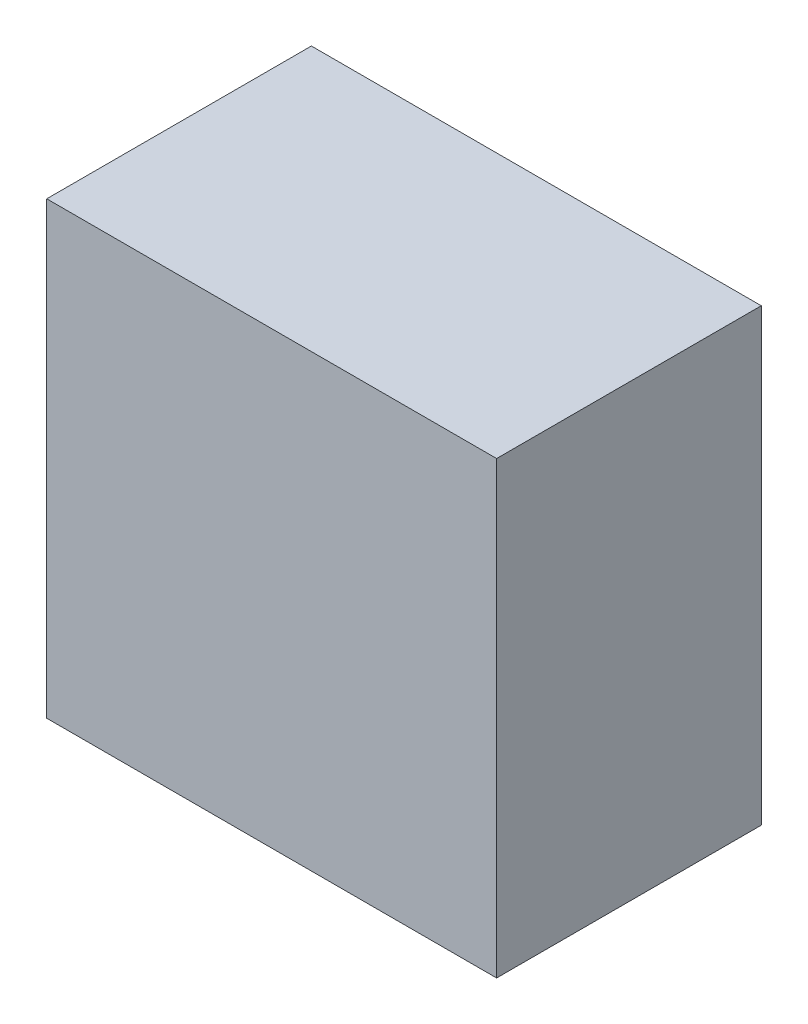
ISO-10303-21;
HEADER;
FILE_DESCRIPTION(('STEP AP214'),'2;1');
FILE_NAME('part.step','',(''),(''),'','','');
FILE_SCHEMA(('AUTOMOTIVE_DESIGN { 1 0 10303 214 1 1 1 1 }'));
ENDSEC;
DATA;
#1=APPLICATION_CONTEXT('core data for automotive mechanical design processes');
#2=APPLICATION_PROTOCOL_DEFINITION('international standard','automotive_design',2000,#1);
#3=PRODUCT_CONTEXT('',#1,'mechanical');
#4=PRODUCT('Part','Part','',(#3));
#5=PRODUCT_RELATED_PRODUCT_CATEGORY('part','',(#4));
#6=PRODUCT_DEFINITION_FORMATION('','',#4);
#7=PRODUCT_DEFINITION_CONTEXT('part definition',#1,'design');
#8=PRODUCT_DEFINITION('design','',#6,#7);
#9=PRODUCT_DEFINITION_SHAPE('','',#8);
#10=(LENGTH_UNIT() NAMED_UNIT(*) SI_UNIT(.MILLI.,.METRE.));
#11=(NAMED_UNIT(*) PLANE_ANGLE_UNIT() SI_UNIT($,.RADIAN.));
#12=(NAMED_UNIT(*) SI_UNIT($,.STERADIAN.) SOLID_ANGLE_UNIT());
#13=UNCERTAINTY_MEASURE_WITH_UNIT(LENGTH_MEASURE(1.E-05),#10,'distance_accuracy_value','');
#14=(GEOMETRIC_REPRESENTATION_CONTEXT(3) GLOBAL_UNCERTAINTY_ASSIGNED_CONTEXT((#13)) GLOBAL_UNIT_ASSIGNED_CONTEXT((#10,
#11,#12)) REPRESENTATION_CONTEXT('',''));
#15=CARTESIAN_POINT('',(0.,0.,0.));
#16=DIRECTION('',(0.,0.,1.));
#17=DIRECTION('',(1.,0.,0.));
#18=AXIS2_PLACEMENT_3D('',#15,#16,#17);
#19=CARTESIAN_POINT('',(-9.82758620689656,14.9310344827586,10.));
#20=DIRECTION('',(1.,0.,0.));
#21=DIRECTION('',(0.,1.,0.));
#22=AXIS2_PLACEMENT_3D('',#19,#20,#21);
#23=PLANE('',#22);
#24=DIRECTION('',(0.,-1.,0.));
#25=VECTOR('',#24,1.);
#26=CARTESIAN_POINT('',(-9.82758620689656,14.9310344827586,0.));
#27=LINE('',#26,#25);
#28=CARTESIAN_POINT('',(-9.82758620689656,14.9310344827586,0.));
#29=VERTEX_POINT('',#28);
#30=CARTESIAN_POINT('',(-9.82758620689656,-2.06896551724138,0.));
#31=VERTEX_POINT('',#30);
#32=EDGE_CURVE('E96',#29,#31,#27,.T.);
#33=ORIENTED_EDGE('',*,*,#32,.T.);
#34=DIRECTION('',(0.,0.,-1.));
#35=VECTOR('',#34,1.);
#36=CARTESIAN_POINT('',(-9.82758620689656,-2.06896551724138,10.));
#37=LINE('',#36,#35);
#38=CARTESIAN_POINT('',(-9.82758620689656,-2.06896551724138,10.));
#39=VERTEX_POINT('',#38);
#40=EDGE_CURVE('E11',#39,#31,#37,.T.);
#41=ORIENTED_EDGE('',*,*,#40,.F.);
#42=DIRECTION('',(0.,-1.,0.));
#43=VECTOR('',#42,1.);
#44=CARTESIAN_POINT('',(-9.82758620689656,14.9310344827586,10.));
#45=LINE('',#44,#43);
#46=CARTESIAN_POINT('',(-9.82758620689656,14.9310344827586,10.));
#47=VERTEX_POINT('',#46);
#48=EDGE_CURVE('E84',#47,#39,#45,.T.);
#49=ORIENTED_EDGE('',*,*,#48,.F.);
#50=DIRECTION('',(0.,0.,-1.));
#51=VECTOR('',#50,1.);
#52=CARTESIAN_POINT('',(-9.82758620689656,14.9310344827586,10.));
#53=LINE('',#52,#51);
#54=EDGE_CURVE('E92',#47,#29,#53,.T.);
#55=ORIENTED_EDGE('',*,*,#54,.T.);
#56=EDGE_LOOP('',(#33,#41,#49,#55));
#57=FACE_BOUND('',#56,.T.);
#58=ADVANCED_FACE('F33',(#57),#23,.F.);
#59=CARTESIAN_POINT('',(-9.82758620689656,-2.06896551724138,10.));
#60=DIRECTION('',(0.,1.,0.));
#61=DIRECTION('',(0.,0.,1.));
#62=AXIS2_PLACEMENT_3D('',#59,#60,#61);
#63=PLANE('',#62);
#64=DIRECTION('',(1.,0.,0.));
#65=VECTOR('',#64,1.);
#66=CARTESIAN_POINT('',(-9.82758620689656,-2.06896551724138,0.));
#67=LINE('',#66,#65);
#68=CARTESIAN_POINT('',(7.17241379310345,-2.06896551724138,0.));
#69=VERTEX_POINT('',#68);
#70=EDGE_CURVE('E88',#31,#69,#67,.T.);
#71=ORIENTED_EDGE('',*,*,#70,.T.);
#72=DIRECTION('',(0.,0.,-1.));
#73=VECTOR('',#72,1.);
#74=CARTESIAN_POINT('',(7.17241379310345,-2.06896551724138,10.));
#75=LINE('',#74,#73);
#76=CARTESIAN_POINT('',(7.17241379310345,-2.06896551724138,10.));
#77=VERTEX_POINT('',#76);
#78=EDGE_CURVE('E41',#77,#69,#75,.T.);
#79=ORIENTED_EDGE('',*,*,#78,.F.);
#80=DIRECTION('',(1.,0.,0.));
#81=VECTOR('',#80,1.);
#82=CARTESIAN_POINT('',(-9.82758620689656,-2.06896551724138,10.));
#83=LINE('',#82,#81);
#84=EDGE_CURVE('E79',#39,#77,#83,.T.);
#85=ORIENTED_EDGE('',*,*,#84,.F.);
#86=ORIENTED_EDGE('',*,*,#40,.T.);
#87=EDGE_LOOP('',(#71,#79,#85,#86));
#88=FACE_BOUND('',#87,.T.);
#89=ADVANCED_FACE('F87',(#88),#63,.F.);
#90=CARTESIAN_POINT('',(7.17241379310345,14.9310344827586,10.));
#91=DIRECTION('',(-1.,0.,0.));
#92=DIRECTION('',(0.,0.,1.));
#93=AXIS2_PLACEMENT_3D('',#90,#91,#92);
#94=PLANE('',#93);
#95=DIRECTION('',(0.,1.,0.));
#96=VECTOR('',#95,1.);
#97=CARTESIAN_POINT('',(7.17241379310345,14.9310344827586,0.));
#98=LINE('',#97,#96);
#99=CARTESIAN_POINT('',(7.17241379310345,14.9310344827586,0.));
#100=VERTEX_POINT('',#99);
#101=EDGE_CURVE('E66',#69,#100,#98,.T.);
#102=ORIENTED_EDGE('',*,*,#101,.T.);
#103=DIRECTION('',(0.,0.,-1.));
#104=VECTOR('',#103,1.);
#105=CARTESIAN_POINT('',(7.17241379310345,14.9310344827586,10.));
#106=LINE('',#105,#104);
#107=CARTESIAN_POINT('',(7.17241379310345,14.9310344827586,10.));
#108=VERTEX_POINT('',#107);
#109=EDGE_CURVE('E89',#108,#100,#106,.T.);
#110=ORIENTED_EDGE('',*,*,#109,.F.);
#111=DIRECTION('',(0.,1.,0.));
#112=VECTOR('',#111,1.);
#113=CARTESIAN_POINT('',(7.17241379310345,14.9310344827586,10.));
#114=LINE('',#113,#112);
#115=EDGE_CURVE('E82',#77,#108,#114,.T.);
#116=ORIENTED_EDGE('',*,*,#115,.F.);
#117=ORIENTED_EDGE('',*,*,#78,.T.);
#118=EDGE_LOOP('',(#102,#110,#116,#117));
#119=FACE_BOUND('',#118,.T.);
#120=ADVANCED_FACE('F90',(#119),#94,.F.);
#121=CARTESIAN_POINT('',(-9.82758620689656,14.9310344827586,10.));
#122=DIRECTION('',(0.,-1.,0.));
#123=DIRECTION('',(0.,0.,-1.));
#124=AXIS2_PLACEMENT_3D('',#121,#122,#123);
#125=PLANE('',#124);
#126=DIRECTION('',(-1.,0.,0.));
#127=VECTOR('',#126,1.);
#128=CARTESIAN_POINT('',(-9.82758620689656,14.9310344827586,0.));
#129=LINE('',#128,#127);
#130=EDGE_CURVE('E72',#100,#29,#129,.T.);
#131=ORIENTED_EDGE('',*,*,#130,.T.);
#132=ORIENTED_EDGE('',*,*,#54,.F.);
#133=DIRECTION('',(-1.,0.,0.));
#134=VECTOR('',#133,1.);
#135=CARTESIAN_POINT('',(-9.82758620689656,14.9310344827586,10.));
#136=LINE('',#135,#134);
#137=EDGE_CURVE('E49',#108,#47,#136,.T.);
#138=ORIENTED_EDGE('',*,*,#137,.F.);
#139=ORIENTED_EDGE('',*,*,#109,.T.);
#140=EDGE_LOOP('',(#131,#132,#138,#139));
#141=FACE_BOUND('',#140,.T.);
#142=ADVANCED_FACE('F103',(#141),#125,.F.);
#143=CARTESIAN_POINT('',(0.,0.,10.));
#144=DIRECTION('',(0.,0.,1.));
#145=DIRECTION('',(1.,0.,0.));
#146=AXIS2_PLACEMENT_3D('',#143,#144,#145);
#147=PLANE('',#146);
#148=ORIENTED_EDGE('',*,*,#48,.T.);
#149=ORIENTED_EDGE('',*,*,#84,.T.);
#150=ORIENTED_EDGE('',*,*,#115,.T.);
#151=ORIENTED_EDGE('',*,*,#137,.T.);
#152=EDGE_LOOP('',(#148,#149,#150,#151));
#153=FACE_BOUND('',#152,.T.);
#154=ADVANCED_FACE('F80',(#153),#147,.T.);
#155=CARTESIAN_POINT('',(0.,0.,0.));
#156=DIRECTION('',(0.,0.,1.));
#157=DIRECTION('',(1.,0.,0.));
#158=AXIS2_PLACEMENT_3D('',#155,#156,#157);
#159=PLANE('',#158);
#160=ORIENTED_EDGE('',*,*,#32,.F.);
#161=ORIENTED_EDGE('',*,*,#130,.F.);
#162=ORIENTED_EDGE('',*,*,#101,.F.);
#163=ORIENTED_EDGE('',*,*,#70,.F.);
#164=EDGE_LOOP('',(#160,#161,#162,#163));
#165=FACE_BOUND('',#164,.T.);
#166=ADVANCED_FACE('F106',(#165),#159,.F.);
#167=CLOSED_SHELL('',(#58,#89,#120,#142,#154,#166));
#168=MANIFOLD_SOLID_BREP('B2',#167);
#169=ADVANCED_BREP_SHAPE_REPRESENTATION('',(#18,#168),#14);
#170=SHAPE_DEFINITION_REPRESENTATION(#9,#169);
ENDSEC;
END-ISO-10303-21;
